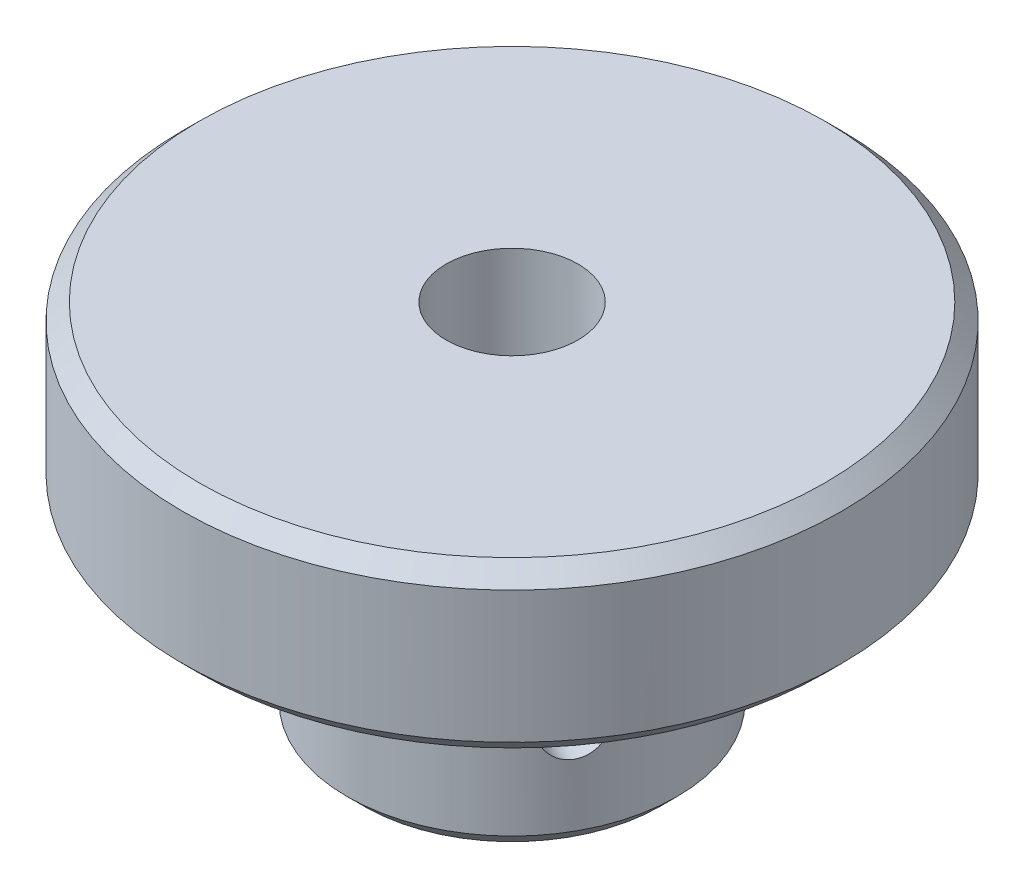
ISO-10303-21;
HEADER;
FILE_DESCRIPTION(('STEP AP214'),'2;1');
FILE_NAME('part.step','',(''),(''),'','','');
FILE_SCHEMA(('AUTOMOTIVE_DESIGN { 1 0 10303 214 1 1 1 1 }'));
ENDSEC;
DATA;
#1=APPLICATION_CONTEXT('core data for automotive mechanical design processes');
#2=APPLICATION_PROTOCOL_DEFINITION('international standard','automotive_design',2000,#1);
#3=PRODUCT_CONTEXT('',#1,'mechanical');
#4=PRODUCT('Part','Part','',(#3));
#5=PRODUCT_RELATED_PRODUCT_CATEGORY('part','',(#4));
#6=PRODUCT_DEFINITION_FORMATION('','',#4);
#7=PRODUCT_DEFINITION_CONTEXT('part definition',#1,'design');
#8=PRODUCT_DEFINITION('design','',#6,#7);
#9=PRODUCT_DEFINITION_SHAPE('','',#8);
#10=(LENGTH_UNIT() NAMED_UNIT(*) SI_UNIT(.MILLI.,.METRE.));
#11=(NAMED_UNIT(*) PLANE_ANGLE_UNIT() SI_UNIT($,.RADIAN.));
#12=(NAMED_UNIT(*) SI_UNIT($,.STERADIAN.) SOLID_ANGLE_UNIT());
#13=UNCERTAINTY_MEASURE_WITH_UNIT(LENGTH_MEASURE(1.E-05),#10,'distance_accuracy_value','');
#14=(GEOMETRIC_REPRESENTATION_CONTEXT(3) GLOBAL_UNCERTAINTY_ASSIGNED_CONTEXT((#13)) GLOBAL_UNIT_ASSIGNED_CONTEXT((#10,
#11,#12)) REPRESENTATION_CONTEXT('',''));
#15=CARTESIAN_POINT('',(0.,0.,0.));
#16=DIRECTION('',(0.,0.,1.));
#17=DIRECTION('',(1.,0.,0.));
#18=AXIS2_PLACEMENT_3D('',#15,#16,#17);
#19=CARTESIAN_POINT('',(0.,10.,0.));
#20=DIRECTION('',(0.,1.,0.));
#21=DIRECTION('',(-1.,0.,0.));
#22=AXIS2_PLACEMENT_3D('',#19,#20,#21);
#23=PLANE('',#22);
#24=CARTESIAN_POINT('',(0.,10.,0.));
#25=DIRECTION('',(0.,1.,0.));
#26=DIRECTION('',(-1.,0.,0.));
#27=AXIS2_PLACEMENT_3D('',#24,#25,#26);
#28=CIRCLE('',#27,19.);
#29=CARTESIAN_POINT('',(-19.,10.,0.));
#30=VERTEX_POINT('',#29);
#31=EDGE_CURVE('E40',#30,#30,#28,.T.);
#32=ORIENTED_EDGE('',*,*,#31,.T.);
#33=EDGE_LOOP('',(#32));
#34=FACE_BOUND('',#33,.T.);
#35=CARTESIAN_POINT('',(0.,10.,0.));
#36=DIRECTION('',(0.,1.,0.));
#37=DIRECTION('',(-1.,0.,0.));
#38=AXIS2_PLACEMENT_3D('',#35,#36,#37);
#39=CIRCLE('',#38,4.);
#40=CARTESIAN_POINT('',(-4.,10.,0.));
#41=VERTEX_POINT('',#40);
#42=EDGE_CURVE('E63',#41,#41,#39,.T.);
#43=ORIENTED_EDGE('',*,*,#42,.F.);
#44=EDGE_LOOP('',(#43));
#45=FACE_BOUND('',#44,.T.);
#46=ADVANCED_FACE('F33',(#34,#45),#23,.T.);
#47=CARTESIAN_POINT('',(0.,-12.,0.));
#48=DIRECTION('',(0.,-1.,0.));
#49=DIRECTION('',(1.,0.,0.));
#50=AXIS2_PLACEMENT_3D('',#47,#48,#49);
#51=CYLINDRICAL_SURFACE('',#50,20.);
#52=CARTESIAN_POINT('',(0.,9.00000000000001,0.));
#53=DIRECTION('',(0.,1.,0.));
#54=DIRECTION('',(-1.,0.,0.));
#55=AXIS2_PLACEMENT_3D('',#52,#53,#54);
#56=CIRCLE('',#55,20.);
#57=CARTESIAN_POINT('',(-20.,9.00000000000001,0.));
#58=VERTEX_POINT('',#57);
#59=EDGE_CURVE('E44',#58,#58,#56,.F.);
#60=ORIENTED_EDGE('',*,*,#59,.T.);
#61=EDGE_LOOP('',(#60));
#62=FACE_BOUND('',#61,.T.);
#63=CARTESIAN_POINT('',(0.,1.00000000000001,0.));
#64=DIRECTION('',(0.,-1.,0.));
#65=DIRECTION('',(1.,0.,0.));
#66=AXIS2_PLACEMENT_3D('',#63,#64,#65);
#67=CIRCLE('',#66,20.);
#68=CARTESIAN_POINT('',(20.,1.00000000000001,0.));
#69=VERTEX_POINT('',#68);
#70=EDGE_CURVE('E48',#69,#69,#67,.F.);
#71=ORIENTED_EDGE('',*,*,#70,.T.);
#72=EDGE_LOOP('',(#71));
#73=FACE_BOUND('',#72,.T.);
#74=ADVANCED_FACE('F109',(#62,#73),#51,.T.);
#75=CARTESIAN_POINT('',(20.,0.,0.));
#76=DIRECTION('',(0.,-1.,0.));
#77=DIRECTION('',(1.,0.,0.));
#78=AXIS2_PLACEMENT_3D('',#75,#76,#77);
#79=PLANE('',#78);
#80=CARTESIAN_POINT('',(0.,0.,0.));
#81=DIRECTION('',(0.,-1.,0.));
#82=DIRECTION('',(1.,0.,0.));
#83=AXIS2_PLACEMENT_3D('',#80,#81,#82);
#84=CIRCLE('',#83,19.);
#85=CARTESIAN_POINT('',(19.,0.,0.));
#86=VERTEX_POINT('',#85);
#87=EDGE_CURVE('E10',#86,#86,#84,.T.);
#88=ORIENTED_EDGE('',*,*,#87,.T.);
#89=EDGE_LOOP('',(#88));
#90=FACE_BOUND('',#89,.T.);
#91=CARTESIAN_POINT('',(0.,0.,0.));
#92=DIRECTION('',(0.,-1.,0.));
#93=DIRECTION('',(1.,0.,0.));
#94=AXIS2_PLACEMENT_3D('',#91,#92,#93);
#95=CIRCLE('',#94,10.);
#96=CARTESIAN_POINT('',(10.,0.,0.));
#97=VERTEX_POINT('',#96);
#98=EDGE_CURVE('E59',#97,#97,#95,.T.);
#99=ORIENTED_EDGE('',*,*,#98,.F.);
#100=EDGE_LOOP('',(#99));
#101=FACE_BOUND('',#100,.T.);
#102=ADVANCED_FACE('F105',(#90,#101),#79,.T.);
#103=CARTESIAN_POINT('',(0.,-12.,0.));
#104=DIRECTION('',(0.,-1.,0.));
#105=DIRECTION('',(1.,0.,0.));
#106=AXIS2_PLACEMENT_3D('',#103,#104,#105);
#107=CYLINDRICAL_SURFACE('',#106,10.);
#108=CARTESIAN_POINT('',(9.39609019943457,-5.5637960661058,3.42249747466519));
#109=CARTESIAN_POINT('',(9.39608980780248,-5.47179422373991,3.42250151496061));
#110=CARTESIAN_POINT('',(9.39341934364294,-5.37974180905924,3.42985765106719));
#111=CARTESIAN_POINT('',(9.38271805600287,-5.19821885276391,3.4590221078147));
#112=CARTESIAN_POINT('',(9.37468225932612,-5.10875078695795,3.48084383666644));
#113=CARTESIAN_POINT('',(9.35322111246821,-4.93504988949026,3.53810446822577));
#114=CARTESIAN_POINT('',(9.33980022765251,-4.85081278692915,3.57353208776078));
#115=CARTESIAN_POINT('',(9.30753943834916,-4.68982584163321,3.6567323184697));
#116=CARTESIAN_POINT('',(9.28870015783612,-4.61307513813756,3.70450350811159));
#117=CARTESIAN_POINT('',(9.24542267422494,-4.46848856365405,3.81123271200631));
#118=CARTESIAN_POINT('',(9.22093745911545,-4.40073553103498,3.87028390011741));
#119=CARTESIAN_POINT('',(9.16656489080921,-4.27678690037909,3.99735598332616));
#120=CARTESIAN_POINT('',(9.13667722011196,-4.22059198202392,4.06537740553786));
#121=CARTESIAN_POINT('',(9.07157999010143,-4.12104438269495,4.20864032857806));
#122=CARTESIAN_POINT('',(9.03634033446551,-4.07776871421619,4.28392172105046));
#123=CARTESIAN_POINT('',(8.96118606823515,-4.00578297732763,4.43898165953918));
#124=CARTESIAN_POINT('',(8.92127175582415,-3.97707198049987,4.51875991854461));
#125=CARTESIAN_POINT('',(8.83795735819996,-3.93528371947005,4.67959765334046));
#126=CARTESIAN_POINT('',(8.79459208958519,-3.92206731691953,4.76063899925598));
#127=CARTESIAN_POINT('',(8.7051590223162,-3.91121081358186,4.92226919105247));
#128=CARTESIAN_POINT('',(8.65909140406356,-3.91356967420226,5.00285806674647));
#129=CARTESIAN_POINT('',(8.56607341433178,-3.93368809380989,5.16049264506234));
#130=CARTESIAN_POINT('',(8.51913595457307,-3.95129791792217,5.23756515001947));
#131=CARTESIAN_POINT('',(8.42547408492829,-4.00118268481555,5.3869438085412));
#132=CARTESIAN_POINT('',(8.37874968147182,-4.03345806725359,5.45924981913724));
#133=CARTESIAN_POINT('',(8.28695292360977,-4.11190704766504,5.59761939801015));
#134=CARTESIAN_POINT('',(8.24188894198544,-4.15814248407168,5.66365343640674));
#135=CARTESIAN_POINT('',(8.15533408432598,-4.26315382904732,5.78759440081469));
#136=CARTESIAN_POINT('',(8.1138434922279,-4.32193073285754,5.84550068123441));
#137=CARTESIAN_POINT('',(8.03563168464842,-4.45118742329912,5.95256917525454));
#138=CARTESIAN_POINT('',(7.99897305218682,-4.52179806483588,6.00161921882916));
#139=CARTESIAN_POINT('',(7.93260542043703,-4.67227656936534,6.08907171993989));
#140=CARTESIAN_POINT('',(7.90289648280762,-4.75214451448089,6.12747408300867));
#141=CARTESIAN_POINT('',(7.85177145278941,-4.91901785988779,6.19285214075249));
#142=CARTESIAN_POINT('',(7.83036436400266,-5.00603088603757,6.21981543237434));
#143=CARTESIAN_POINT('',(7.7969395106955,-5.18464266639263,6.26166579480786));
#144=CARTESIAN_POINT('',(7.78492093690428,-5.27624102462724,6.27655390647962));
#145=CARTESIAN_POINT('',(7.77096607136301,-5.46027476118353,6.29382315078685));
#146=CARTESIAN_POINT('',(7.76891338387365,-5.55268778366602,6.29634867413063));
#147=CARTESIAN_POINT('',(7.77467858665657,-5.7367306527408,6.28922833591185));
#148=CARTESIAN_POINT('',(7.78249610359206,-5.82836052882333,6.27958293470997));
#149=CARTESIAN_POINT('',(7.80752822977126,-6.00765627930492,6.24843132817266));
#150=CARTESIAN_POINT('',(7.8246844193381,-6.09534316570758,6.22699885039333));
#151=CARTESIAN_POINT('',(7.86752757013855,-6.26493027369883,6.17277868338241));
#152=CARTESIAN_POINT('',(7.89321503254636,-6.34683015498383,6.1399903270388));
#153=CARTESIAN_POINT('',(7.95221075753145,-6.50333345528128,6.06338959668827));
#154=CARTESIAN_POINT('',(7.98558586616549,-6.57786415597628,6.01948016746968));
#155=CARTESIAN_POINT('',(8.05835960282304,-6.71676209117471,5.92170125612335));
#156=CARTESIAN_POINT('',(8.09775864573787,-6.78112862501204,5.86783108790799));
#157=CARTESIAN_POINT('',(8.1813753398797,-6.89853816418592,5.75067987542483));
#158=CARTESIAN_POINT('',(8.22563796586839,-6.95145921187159,5.68730860213637));
#159=CARTESIAN_POINT('',(8.31688203109189,-7.04362177176345,5.55302200480818));
#160=CARTESIAN_POINT('',(8.3638633836854,-7.08286371962021,5.48210692111683));
#161=CARTESIAN_POINT('',(8.45857506291787,-7.1463638304509,5.33480414034749));
#162=CARTESIAN_POINT('',(8.50630126770778,-7.17068611140344,5.25844145843101));
#163=CARTESIAN_POINT('',(8.60104024282023,-7.20386303970591,5.10200575410149));
#164=CARTESIAN_POINT('',(8.64805307032513,-7.21271893336137,5.02193303118315));
#165=CARTESIAN_POINT('',(8.73934045624668,-7.21467640543294,4.86131276773048));
#166=CARTESIAN_POINT('',(8.78364088499589,-7.20796365396141,4.78078213216221));
#167=CARTESIAN_POINT('',(8.86891868571736,-7.17937560419376,4.62066140607936));
#168=CARTESIAN_POINT('',(8.90989607539983,-7.15750038671222,4.54107131055407));
#169=CARTESIAN_POINT('',(8.98758847635591,-7.09927905869903,4.38529674782896));
#170=CARTESIAN_POINT('',(9.02430799397675,-7.06294843104704,4.30910873352859));
#171=CARTESIAN_POINT('',(9.09293014210087,-6.97686815397443,4.16235408728425));
#172=CARTESIAN_POINT('',(9.12483255152364,-6.92711788895318,4.09178771341485));
#173=CARTESIAN_POINT('',(9.1837921927189,-6.81495096616707,3.95770052074887));
#174=CARTESIAN_POINT('',(9.21079093445193,-6.75239822395677,3.8942678088189));
#175=CARTESIAN_POINT('',(9.2593278258594,-6.61668769391363,3.77741473058092));
#176=CARTESIAN_POINT('',(9.28086469501704,-6.54352742549073,3.72399671294676));
#177=CARTESIAN_POINT('',(9.31855461077213,-6.38807824033645,3.62866278723007));
#178=CARTESIAN_POINT('',(9.33466938685465,-6.30572968082512,3.58682899541739));
#179=CARTESIAN_POINT('',(9.36131688275133,-6.13467802909182,3.51669811790072));
#180=CARTESIAN_POINT('',(9.37185520270094,-6.04598141392168,3.48838745443675));
#181=CARTESIAN_POINT('',(9.38512254303905,-5.89141076656954,3.45249415035482));
#182=CARTESIAN_POINT('',(9.3892355686163,-5.82647470107992,3.44126716068695));
#183=CARTESIAN_POINT('',(9.39471951306307,-5.69563309173657,3.42626744059655));
#184=CARTESIAN_POINT('',(9.3960904800908,-5.62972756492976,3.42249457925869));
#185=CARTESIAN_POINT('',(9.39609019943457,-5.5637960661058,3.42249747466519));
#186=B_SPLINE_CURVE_WITH_KNOTS('',3,(#108,#109,#110,#111,#112,#113,#114,#115,#116,#117,#118,
#119,#120,#121,#122,#123,#124,#125,#126,#127,#128,#129,#130,#131,#132,#133,#134,#135,#136,#137,
#138,#139,#140,#141,#142,#143,#144,#145,#146,#147,#148,#149,#150,#151,#152,#153,#154,#155,#156,
#157,#158,#159,#160,#161,#162,#163,#164,#165,#166,#167,#168,#169,#170,#171,#172,#173,#174,#175,
#176,#177,#178,#179,#180,#181,#182,#183,#184,#185),.UNSPECIFIED.,.T.,.F.,(4,2,2,2,2,2,2,2,2,2,2,
2,2,2,2,2,2,2,2,2,2,2,2,2,2,2,2,2,2,2,2,2,2,2,2,2,2,2,4),(0.,0.275764439202392,
0.551784843546745,0.827576840629569,1.10333709061228,1.38148219258882,1.65964364637685,
1.93943156735329,2.21920165114179,2.49643973106727,2.77365932434103,3.04818762343249,
3.32272415311683,3.59849508924514,3.8742879176082,4.15336037881897,4.43243531591038,
4.71181207725746,4.99116475423997,5.26724677423092,5.54331835183576,5.81768243813564,
6.09206264495275,6.36892529029639,6.6458070128228,6.92550769092012,7.20519946032491,
7.48368066222355,7.76213942263835,8.03729441534006,8.31244794150175,8.58730754656385,
8.86217976243817,9.14014153059554,9.41816840579299,9.69811840194758,9.97778672322848,
10.175411919191,10.3730336442719),.UNSPECIFIED.);
#187=CARTESIAN_POINT('',(9.39609019943457,-5.5637960661058,3.42249747466519));
#188=VERTEX_POINT('',#187);
#189=EDGE_CURVE('E210',#188,#188,#186,.T.);
#190=ORIENTED_EDGE('',*,*,#189,.F.);
#191=EDGE_LOOP('',(#190));
#192=FACE_BOUND('',#191,.T.);
#193=CARTESIAN_POINT('',(-1.73407534226919,-5.5637960661058,-9.84850154629292));
#194=CARTESIAN_POINT('',(-1.73407164745468,-5.47179422373991,-9.84850322727728));
#195=CARTESIAN_POINT('',(-1.72636581463291,-5.37974180905924,-9.84986860552852));
#196=CARTESIAN_POINT('',(-1.69575801038196,-5.19821885276391,-9.85518324695277));
#197=CARTESIAN_POINT('',(-1.67284194050348,-5.10875078695795,-9.85913490731693));
#198=CARTESIAN_POINT('',(-1.61252220550741,-4.93504988949026,-9.8691793247233));
#199=CARTESIAN_POINT('',(-1.57513054458663,-4.85081278692915,-9.87527030729915));
#200=CARTESIAN_POINT('',(-1.4869466365403,-4.68982584163321,-9.88893175957076));
#201=CARTESIAN_POINT('',(-1.4361559324849,-4.61307513813756,-9.8965020588784));
#202=CARTESIAN_POINT('',(-1.3220869887808,-4.46848856365405,-9.9123872606066));
#203=CARTESIAN_POINT('',(-1.25870455219818,-4.40073553103498,-9.92070803636022));
#204=CARTESIAN_POINT('',(-1.12147061587448,-4.27678690037909,-9.93715605254238));
#205=CARTESIAN_POINT('',(-1.04761850088897,-4.22059198202392,-9.94528328156446));
#206=CARTESIAN_POINT('',(-0.891000555110477,-4.12104438269495,-9.96053888817945));
#207=CARTESIAN_POINT('',(-0.808185128979153,-4.07776871421619,-9.96766114741432));
#208=CARTESIAN_POINT('',(-0.63632215002349,-4.00578297732763,-9.98010561290042));
#209=CARTESIAN_POINT('',(-0.547274994849592,-3.97707198049987,-9.98542793388063));
#210=CARTESIAN_POINT('',(-0.366328231817144,-3.93528371947005,-9.993694416435));
#211=CARTESIAN_POINT('',(-0.274461733190037,-3.92206731691953,-9.99665966513044));
#212=CARTESIAN_POINT('',(-0.0897693474412344,-3.91121081358186,-10.0000234528354));
#213=CARTESIAN_POINT('',(0.00305647529851831,-3.91356967420226,-10.0004221629837));
#214=CARTESIAN_POINT('',(0.186081019500804,-3.93368809380989,-9.998683510025));
#215=CARTESIAN_POINT('',(0.276296496606327,-3.95129791792217,-9.99657072996341));
#216=CARTESIAN_POINT('',(0.452493144491774,-4.00118268481555,-9.99014650074595));
#217=CARTESIAN_POINT('',(0.538474188242488,-4.03345806725359,-9.98583498567399));
#218=CARTESIAN_POINT('',(0.704204137588413,-4.11190704766504,-9.97552145081687));
#219=CARTESIAN_POINT('',(0.783923283166498,-4.15814248407168,-9.96951191713281));
#220=CARTESIAN_POINT('',(0.93453673574306,-4.26315382904732,-9.95652369378275));
#221=CARTESIAN_POINT('',(1.00543034167424,-4.32193073285754,-9.94954492721761));
#222=CARTESIAN_POINT('',(1.13726028123036,-4.45118742329912,-9.93534576198795));
#223=CARTESIAN_POINT('',(1.19806818125351,-4.52179806483588,-9.92812347679552));
#224=CARTESIAN_POINT('',(1.30698808471478,-4.67227656936534,-9.91437367226655));
#225=CARTESIAN_POINT('',(1.3550999755124,-4.75214451448088,-9.90784615909443));
#226=CARTESIAN_POINT('',(1.43728154937774,-4.91901785988779,-9.89625961320133));
#227=CARTESIAN_POINT('',(1.47133598928529,-5.00603088603757,-9.89120217630186));
#228=CARTESIAN_POINT('',(1.52429189296388,-5.18464266639263,-9.88318058543686));
#229=CARTESIAN_POINT('',(1.54319466278162,-5.27624102462724,-9.88021625105228));
#230=CARTESIAN_POINT('',(1.56512769982648,-5.46027476118353,-9.87676560514076));
#231=CARTESIAN_POINT('',(1.56834121094471,-5.55268778366602,-9.87625068730083));
#232=CARTESIAN_POINT('',(1.55929221577226,-5.7367306527408,-9.87768333025942));
#233=CARTESIAN_POINT('',(1.54703029483399,-5.82836052882333,-9.87963079791913));
#234=CARTESIAN_POINT('',(1.50753614911439,-6.00765627930492,-9.8857334518324));
#235=CARTESIAN_POINT('',(1.48039698410802,-6.09534316570758,-9.88987490893976));
#236=CARTESIAN_POINT('',(1.41201936667891,-6.26493027369883,-9.89986808240566));
#237=CARTESIAN_POINT('',(1.37078008593309,-6.34683015498383,-9.90571989923777));
#238=CARTESIAN_POINT('',(1.27494404500854,-6.50333345528128,-9.91851133061427));
#239=CARTESIAN_POINT('',(1.22022980952256,-6.57786415597628,-9.92546030793612));
#240=CARTESIAN_POINT('',(1.09916392001347,-6.71676209117471,-9.93959475693671));
#241=CARTESIAN_POINT('',(1.03281146437541,-6.78112862501204,-9.94678024487807));
#242=CARTESIAN_POINT('',(0.889547191209935,-6.89853816418592,-9.96061881994378));
#243=CARTESIAN_POINT('',(0.812534745677618,-6.95145921187159,-9.96726574184397));
#244=CARTESIAN_POINT('',(0.650617108391875,-7.04362177176345,-9.97914212160799));
#245=CARTESIAN_POINT('',(0.565712168106918,-7.08286371962021,-9.98437162461245));
#246=CARTESIAN_POINT('',(0.390788378296343,-7.1463638304509,-9.99274295447818));
#247=CARTESIAN_POINT('',(0.300793253460604,-7.17068611140344,-9.99589371929422));
#248=CARTESIAN_POINT('',(0.117946471896106,-7.20386303970591,-9.99972222630533));
#249=CARTESIAN_POINT('',(0.0250950459461773,-7.21271893336137,-10.0004001677691));
#250=CARTESIAN_POINT('',(-0.159649875527157,-7.21467640543294,-9.99914723129595));
#251=CARTESIAN_POINT('',(-0.251541666086785,-7.20796365396141,-9.99724721020717));
#252=CARTESIAN_POINT('',(-0.432849182907684,-7.17937560419376,-9.99103958896941));
#253=CARTESIAN_POINT('',(-0.522264922363444,-7.15750038671222,-9.98673200165256));
#254=CARTESIAN_POINT('',(-0.696015851424849,-7.09927905869903,-9.97612831319897));
#255=CARTESIAN_POINT('',(-0.780356366083273,-7.06294843104704,-9.96983434112314));
#256=CARTESIAN_POINT('',(-0.941760691916341,-6.97686815397443,-9.95588554153872));
#257=CARTESIAN_POINT('',(-1.01882416905157,-6.92711788895318,-9.94823065160607));
#258=CARTESIAN_POINT('',(-1.16442690482008,-6.81495096616707,-9.93224760234619));
#259=CARTESIAN_POINT('',(-1.23286061564888,-6.75239822395677,-9.92391284259222));
#260=CARTESIAN_POINT('',(-1.35832679561713,-6.61668769391363,-9.90752048445283));
#261=CARTESIAN_POINT('',(-1.41535659048693,-6.54352742549073,-9.89946295144424));
#262=CARTESIAN_POINT('',(-1.51676314987762,-6.38807824033645,-9.88443641309631));
#263=CARTESIAN_POINT('',(-1.5610496643653,-6.30572968082512,-9.87747532265372));
#264=CARTESIAN_POINT('',(-1.63510853383277,-6.13467802909182,-9.86548729228915));
#265=CARTESIAN_POINT('',(-1.66489544756537,-6.04598141392168,-9.86045841334674));
#266=CARTESIAN_POINT('',(-1.70261363089513,-5.89141076656954,-9.85400161507923));
#267=CARTESIAN_POINT('',(-1.71439300194416,-5.82647470107993,-9.85195010488161));
#268=CARTESIAN_POINT('',(-1.73012511281548,-5.69563309173657,-9.84919948004025));
#269=CARTESIAN_POINT('',(-1.73407799009289,-5.62972756492976,-9.8485003416451));
#270=CARTESIAN_POINT('',(-1.73407534226919,-5.5637960661058,-9.84850154629292));
#271=B_SPLINE_CURVE_WITH_KNOTS('',3,(#193,#194,#195,#196,#197,#198,#199,#200,#201,#202,#203,
#204,#205,#206,#207,#208,#209,#210,#211,#212,#213,#214,#215,#216,#217,#218,#219,#220,#221,#222,
#223,#224,#225,#226,#227,#228,#229,#230,#231,#232,#233,#234,#235,#236,#237,#238,#239,#240,#241,
#242,#243,#244,#245,#246,#247,#248,#249,#250,#251,#252,#253,#254,#255,#256,#257,#258,#259,#260,
#261,#262,#263,#264,#265,#266,#267,#268,#269,#270),.UNSPECIFIED.,.T.,.F.,(4,2,2,2,2,2,2,2,2,2,2,
2,2,2,2,2,2,2,2,2,2,2,2,2,2,2,2,2,2,2,2,2,2,2,2,2,2,2,4),(0.,0.275764439202392,
0.551784843546745,0.827576840629569,1.10333709061228,1.38148219258882,1.65964364637685,
1.9394315673533,2.21920165114179,2.49643973106727,2.77365932434103,3.04818762343249,
3.32272415311683,3.59849508924514,3.87428791760821,4.15336037881897,4.43243531591038,
4.71181207725746,4.99116475423997,5.26724677423092,5.54331835183576,5.81768243813564,
6.09206264495275,6.36892529029639,6.6458070128228,6.92550769092012,7.20519946032491,
7.48368066222355,7.76213942263835,8.03729441534006,8.31244794150175,8.58730754656385,
8.86217976243817,9.14014153059554,9.41816840579299,9.69811840194758,9.97778672322848,
10.175411919191,10.3730336442719),.UNSPECIFIED.);
#272=CARTESIAN_POINT('',(-1.73407534226919,-5.5637960661058,-9.84850154629292));
#273=VERTEX_POINT('',#272);
#274=EDGE_CURVE('E66',#273,#273,#271,.T.);
#275=ORIENTED_EDGE('',*,*,#274,.F.);
#276=EDGE_LOOP('',(#275));
#277=FACE_BOUND('',#276,.T.);
#278=CARTESIAN_POINT('',(0.,-11.,0.));
#279=DIRECTION('',(0.,-1.,0.));
#280=DIRECTION('',(1.,0.,0.));
#281=AXIS2_PLACEMENT_3D('',#278,#279,#280);
#282=CIRCLE('',#281,10.);
#283=CARTESIAN_POINT('',(10.,-11.,0.));
#284=VERTEX_POINT('',#283);
#285=EDGE_CURVE('E53',#284,#284,#282,.F.);
#286=ORIENTED_EDGE('',*,*,#285,.T.);
#287=EDGE_LOOP('',(#286));
#288=FACE_BOUND('',#287,.T.);
#289=ORIENTED_EDGE('',*,*,#98,.T.);
#290=EDGE_LOOP('',(#289));
#291=FACE_BOUND('',#290,.T.);
#292=ADVANCED_FACE('F80',(#192,#277,#288,#291),#107,.T.);
#293=CARTESIAN_POINT('',(10.,-12.,0.));
#294=DIRECTION('',(0.,-1.,0.));
#295=DIRECTION('',(1.,0.,0.));
#296=AXIS2_PLACEMENT_3D('',#293,#294,#295);
#297=PLANE('',#296);
#298=CARTESIAN_POINT('',(0.,-12.,0.));
#299=DIRECTION('',(0.,-1.,0.));
#300=DIRECTION('',(1.,0.,0.));
#301=AXIS2_PLACEMENT_3D('',#298,#299,#300);
#302=CIRCLE('',#301,9.00000000000001);
#303=CARTESIAN_POINT('',(9.00000000000001,-12.,0.));
#304=VERTEX_POINT('',#303);
#305=EDGE_CURVE('E56',#304,#304,#302,.T.);
#306=ORIENTED_EDGE('',*,*,#305,.T.);
#307=EDGE_LOOP('',(#306));
#308=FACE_BOUND('',#307,.T.);
#309=CARTESIAN_POINT('',(0.,-12.,0.));
#310=DIRECTION('',(0.,1.,0.));
#311=DIRECTION('',(-1.,0.,0.));
#312=AXIS2_PLACEMENT_3D('',#309,#310,#311);
#313=CIRCLE('',#312,4.);
#314=CARTESIAN_POINT('',(-4.,-12.,0.));
#315=VERTEX_POINT('',#314);
#316=EDGE_CURVE('E62',#315,#315,#313,.T.);
#317=ORIENTED_EDGE('',*,*,#316,.T.);
#318=EDGE_LOOP('',(#317));
#319=FACE_BOUND('',#318,.T.);
#320=ADVANCED_FACE('F98',(#308,#319),#297,.T.);
#321=CARTESIAN_POINT('',(0.,-12.,0.));
#322=DIRECTION('',(0.,1.,0.));
#323=DIRECTION('',(-1.,0.,0.));
#324=AXIS2_PLACEMENT_3D('',#321,#322,#323);
#325=CYLINDRICAL_SURFACE('',#324,4.);
#326=CARTESIAN_POINT('',(3.98385710217057,-5.5637960661058,0.359002213760742));
#327=CARTESIAN_POINT('',(3.98386033241118,-5.47569958588011,0.359014880179871));
#328=CARTESIAN_POINT('',(3.98318042736838,-5.3874556341322,0.366777808354675));
#329=CARTESIAN_POINT('',(3.98023870469677,-5.21350900502692,0.3973920932626));
#330=CARTESIAN_POINT('',(3.97797255134319,-5.12781396550819,0.420284794917056));
#331=CARTESIAN_POINT('',(3.97124142676262,-4.96179312797516,0.47971365014568));
#332=CARTESIAN_POINT('',(3.9667852767612,-4.8814472458872,0.516194927894825));
#333=CARTESIAN_POINT('',(3.95481809499869,-4.72761429927157,0.601033801282838));
#334=CARTESIAN_POINT('',(3.94730782801639,-4.65412552332176,0.649388422527945));
#335=CARTESIAN_POINT('',(3.92773356248436,-4.5115673782593,0.75906157183803));
#336=CARTESIAN_POINT('',(3.91544080679254,-4.44296681032559,0.820948932433961));
#337=CARTESIAN_POINT('',(3.88524697962236,-4.31644129419704,0.953669352293216));
#338=CARTESIAN_POINT('',(3.8673437777205,-4.25852041463358,1.02450580363616));
#339=CARTESIAN_POINT('',(3.82406991218694,-4.15262469480394,1.17598625022312));
#340=CARTESIAN_POINT('',(3.79841503854798,-4.10517513339964,1.25691859475215));
#341=CARTESIAN_POINT('',(3.73930060813693,-4.0251259207841,1.42316402448174));
#342=CARTESIAN_POINT('',(3.70584446028484,-3.99251980175924,1.5084751836113));
#343=CARTESIAN_POINT('',(3.63305339435657,-3.94477535944957,1.67595588963982));
#344=CARTESIAN_POINT('',(3.5941064760414,-3.92882921818257,1.75806306742625));
#345=CARTESIAN_POINT('',(3.50994707186249,-3.91224941425063,1.92058113912479));
#346=CARTESIAN_POINT('',(3.46473708132109,-3.91160967078379,2.00099269397506));
#347=CARTESIAN_POINT('',(3.37236306270651,-3.9252325622424,2.15281156794265));
#348=CARTESIAN_POINT('',(3.32547660274481,-3.9386082498229,2.22446986373994));
#349=CARTESIAN_POINT('',(3.22910165472262,-3.97836488355356,2.36219601333241));
#350=CARTESIAN_POINT('',(3.17961297529145,-4.00474678739648,2.42826345503385));
#351=CARTESIAN_POINT('',(3.07915379412402,-4.07008372782598,2.55449082390235));
#352=CARTESIAN_POINT('',(3.02817220310961,-4.10922405603067,2.61454550746086));
#353=CARTESIAN_POINT('',(2.92749471529552,-4.1987873452924,2.7268055915911));
#354=CARTESIAN_POINT('',(2.87779927662819,-4.24921426660911,2.77900822624577));
#355=CARTESIAN_POINT('',(2.77842520006189,-4.36398430513444,2.87847770334571));
#356=CARTESIAN_POINT('',(2.7289862259579,-4.42904947700453,2.92515207895442));
#357=CARTESIAN_POINT('',(2.63646543979333,-4.56920573242737,3.00881189393813));
#358=CARTESIAN_POINT('',(2.59338598582366,-4.6443005153691,3.04579374327505));
#359=CARTESIAN_POINT('',(2.51494005215271,-4.80539446965311,3.11091057834761));
#360=CARTESIAN_POINT('',(2.47986100650039,-4.89166363779845,3.13872833874396));
#361=CARTESIAN_POINT('',(2.42195150081638,-5.07084273751169,3.1836315173272));
#362=CARTESIAN_POINT('',(2.39911248704208,-5.16374797997961,3.20072443182441));
#363=CARTESIAN_POINT('',(2.36876734573542,-5.34721896129078,3.22324031242516));
#364=CARTESIAN_POINT('',(2.36037408444916,-5.43755436728866,3.2293396671017));
#365=CARTESIAN_POINT('',(2.3569039225348,-5.61860169580439,3.2318744759268));
#366=CARTESIAN_POINT('',(2.3618225653323,-5.70931348216508,3.2283131642833));
#367=CARTESIAN_POINT('',(2.3837965460427,-5.88259707515527,3.21211396948719));
#368=CARTESIAN_POINT('',(2.40007797901446,-5.9653242457804,3.20005440711299));
#369=CARTESIAN_POINT('',(2.44270851700071,-6.12643313048577,3.16763111901362));
#370=CARTESIAN_POINT('',(2.46905994423972,-6.20481383745745,3.14726547776457));
#371=CARTESIAN_POINT('',(2.53141481836273,-6.35867507180143,3.09735254534978));
#372=CARTESIAN_POINT('',(2.56777659087148,-6.43389626088504,3.06745612763351));
#373=CARTESIAN_POINT('',(2.64746587645599,-6.57625623553553,2.99894692559133));
#374=CARTESIAN_POINT('',(2.69079635928224,-6.64339155384091,2.96033042231004));
#375=CARTESIAN_POINT('',(2.78591925972223,-6.77322569255251,2.87110247766829));
#376=CARTESIAN_POINT('',(2.8381105100377,-6.83514780315451,2.81978162241194));
#377=CARTESIAN_POINT('',(2.94543885220902,-6.94643892176786,2.70747418618682));
#378=CARTESIAN_POINT('',(3.00057613426107,-6.99580711810899,2.64648698065619));
#379=CARTESIAN_POINT('',(3.1112445710036,-7.08050020031258,2.51545525615429));
#380=CARTESIAN_POINT('',(3.16677625748903,-7.11579954110852,2.44539456503056));
#381=CARTESIAN_POINT('',(3.27548399149611,-7.17078772296454,2.29773551017077));
#382=CARTESIAN_POINT('',(3.32866139290632,-7.19048564904473,2.22014156280047));
#383=CARTESIAN_POINT('',(3.4268067525273,-7.21258429502627,2.06514624759203));
#384=CARTESIAN_POINT('',(3.47208775136141,-7.21608089484773,1.98809824928485));
#385=CARTESIAN_POINT('',(3.55708561304329,-7.20861063173551,1.83168208665135));
#386=CARTESIAN_POINT('',(3.59680341611969,-7.19764621611034,1.75231431713384));
#387=CARTESIAN_POINT('',(3.66854131799857,-7.16235142397023,1.59653235247111));
#388=CARTESIAN_POINT('',(3.70077844717894,-7.13849162399124,1.52011008852272));
#389=CARTESIAN_POINT('',(3.75903852071895,-7.0785919512258,1.36972222639627));
#390=CARTESIAN_POINT('',(3.78506027106047,-7.04254974131911,1.29575710259797));
#391=CARTESIAN_POINT('',(3.83218812630829,-6.9574915394194,1.14914343499756));
#392=CARTESIAN_POINT('',(3.85302040519324,-6.90796480933286,1.07670383749951));
#393=CARTESIAN_POINT('',(3.88889167084599,-6.79809321931579,0.938934377497091));
#394=CARTESIAN_POINT('',(3.90392855410958,-6.73774444302498,0.873607102651773));
#395=CARTESIAN_POINT('',(3.92998478108226,-6.60320853875113,0.748064618129387));
#396=CARTESIAN_POINT('',(3.94067074244692,-6.52836830922085,0.688477610185932));
#397=CARTESIAN_POINT('',(3.95778003350778,-6.36953009042473,0.58214246579191));
#398=CARTESIAN_POINT('',(3.96420100957356,-6.2855270743962,0.535401426710401));
#399=CARTESIAN_POINT('',(3.97395023296884,-6.1110676248359,0.457450427170412));
#400=CARTESIAN_POINT('',(3.97729841952554,-6.02065695801469,0.426140955044866));
#401=CARTESIAN_POINT('',(3.98191211888816,-5.83574892202743,0.380684579746799));
#402=CARTESIAN_POINT('',(3.98318462254193,-5.74126637522892,0.366480109852021));
#403=CARTESIAN_POINT('',(3.98378814721134,-5.61893275246315,0.35975364500046));
#404=CARTESIAN_POINT('',(3.98385609105505,-5.59137163382078,0.358998248974663));
#405=CARTESIAN_POINT('',(3.98385710217057,-5.5637960661058,0.359002213760742));
#406=B_SPLINE_CURVE_WITH_KNOTS('',3,(#326,#327,#328,#329,#330,#331,#332,#333,#334,#335,#336,
#337,#338,#339,#340,#341,#342,#343,#344,#345,#346,#347,#348,#349,#350,#351,#352,#353,#354,#355,
#356,#357,#358,#359,#360,#361,#362,#363,#364,#365,#366,#367,#368,#369,#370,#371,#372,#373,#374,
#375,#376,#377,#378,#379,#380,#381,#382,#383,#384,#385,#386,#387,#388,#389,#390,#391,#392,#393,
#394,#395,#396,#397,#398,#399,#400,#401,#402,#403,#404,#405),.UNSPECIFIED.,.T.,.F.,(4,2,2,2,2,2,
2,2,2,2,2,2,2,2,2,2,2,2,2,2,2,2,2,2,2,2,2,2,2,2,2,2,2,2,2,2,2,2,2,4),(0.,0.264211724660744,
0.529148459018596,0.793026677872047,1.05683885985756,1.33523297260791,1.61373292676209,
1.90403076094907,2.19420198072698,2.46953816244269,2.74476495901023,3.00356896819765,
3.2623920368679,3.52515526924738,3.78801084539544,4.06907613148063,4.35024537535723,
4.64031806272421,4.93018777241109,5.20152035698261,5.4727621157604,5.72713321026164,
5.98156300028878,6.24665916965706,6.51186861189121,6.79815687284344,7.0844636389886,
7.37128791456168,7.65794504349148,7.92489841526076,8.19180661499932,8.44957452423756,
8.70739191275385,8.97680852354691,9.24632283025303,9.53374725602171,9.82133016535512,
10.1070334851925,10.3917725616093,10.4744749384331),.UNSPECIFIED.);
#407=CARTESIAN_POINT('',(3.98385710217057,-5.5637960661058,0.359002213760742));
#408=VERTEX_POINT('',#407);
#409=EDGE_CURVE('E207',#408,#408,#406,.T.);
#410=ORIENTED_EDGE('',*,*,#409,.T.);
#411=EDGE_LOOP('',(#410));
#412=FACE_BOUND('',#411,.T.);
#413=CARTESIAN_POINT('',(-1.68102351395365,-5.5637960661058,-3.62962256240713));
#414=CARTESIAN_POINT('',(-1.68101415963321,-5.47569958588011,-3.62963169308713));
#415=CARTESIAN_POINT('',(-1.67395131410468,-5.3874556341322,-3.6329243421353));
#416=CARTESIAN_POINT('',(-1.64596770431992,-5.21350900502692,-3.64568387802476));
#417=CARTESIAN_POINT('',(-1.62500896644911,-5.12781396550819,-3.65516768247892));
#418=CARTESIAN_POINT('',(-1.57017650581301,-4.96179312797516,-3.67905278521042));
#419=CARTESIAN_POINT('',(-1.53635471751902,-4.8814472458872,-3.69343428498069));
#420=CARTESIAN_POINT('',(-1.4568985070553,-4.72761429927157,-3.72548983825665));
#421=CARTESIAN_POINT('',(-1.41126704317551,-4.65412552332176,-3.74316306688334));
#422=CARTESIAN_POINT('',(-1.30650017699392,-4.5115673782593,-3.78104783032722));
#423=CARTESIAN_POINT('',(-1.24675777269876,-4.44296681032559,-3.80134567191355));
#424=CARTESIAN_POINT('',(-1.11672160391463,-4.31644129419704,-3.84155726047633));
#425=CARTESIAN_POINT('',(-1.04642383658676,-4.25852041463358,-3.86147085849171));
#426=CARTESIAN_POINT('',(-0.893600988899064,-4.15262469480394,-3.89973481491318));
#427=CARTESIAN_POINT('',(-0.81068408572961,-4.10517513339964,-3.91798321487546));
#428=CARTESIAN_POINT('',(-0.637154105115197,-4.0251259207841,-3.94991133127405));
#429=CARTESIAN_POINT('',(-0.546544400156661,-3.99251980175924,-3.96359303688615));
#430=CARTESIAN_POINT('',(-0.365106321128069,-3.94477535944957,-3.98429447763798));
#431=CARTESIAN_POINT('',(-0.274525960174399,-3.92882921818257,-3.99161904587114));
#432=CARTESIAN_POINT('',(-0.09170147941994,-3.91224941425063,-3.99999389973412));
#433=CARTESIAN_POINT('',(0.000541965108894231,-3.91160967078379,-4.00104667684554));
#434=CARTESIAN_POINT('',(0.178207976046072,-3.9252325622424,-3.99695786705946));
#435=CARTESIAN_POINT('',(0.263709110579269,-3.9386082498229,-3.99218214953775));
#436=CARTESIAN_POINT('',(0.431170928902863,-3.97836488355356,-3.97758207105836));
#437=CARTESIAN_POINT('',(0.513131351494941,-4.00474678739648,-3.96775733832195));
#438=CARTESIAN_POINT('',(0.672677050171647,-4.07008372782598,-3.94387081982182));
#439=CARTESIAN_POINT('',(0.750176727256758,-4.10922405603067,-3.92974680865725));
#440=CARTESIAN_POINT('',(0.897735555851569,-4.1987873452924,-3.89868758868617));
#441=CARTESIAN_POINT('',(0.967792082940652,-4.24921426660911,-3.88175139367538));
#442=CARTESIAN_POINT('',(1.10362221529351,-4.36398430513444,-3.84542565744132));
#443=CARTESIAN_POINT('',(1.16876289732842,-4.42904947700453,-3.82594743773458));
#444=CARTESIAN_POINT('',(1.28747481546251,-4.56920573242737,-3.78765199402981));
#445=CARTESIAN_POINT('',(1.34104176345204,-4.6443005153691,-3.76883501717937));
#446=CARTESIAN_POINT('',(1.4366575636744,-4.80539446965311,-3.73345726333302));
#447=CARTESIAN_POINT('',(1.47828797368019,-4.89166363779845,-3.71698679885577));
#448=CARTESIAN_POINT('',(1.54613001988594,-5.07084273751169,-3.68928728510444));
#449=CARTESIAN_POINT('',(1.57235242495239,-5.16374797997961,-3.67805457622712));
#450=CARTESIAN_POINT('',(1.60702432019455,-5.34721896129078,-3.6630328532745));
#451=CARTESIAN_POINT('',(1.61650314693425,-5.43755436728866,-3.65881375311827));
#452=CARTESIAN_POINT('',(1.62043343672771,-5.61860169580439,-3.65707590915774));
#453=CARTESIAN_POINT('',(1.6148899289749,-5.70931348216508,-3.65955492295077));
#454=CARTESIAN_POINT('',(1.58987402440541,-5.88259707515527,-3.67048535107019));
#455=CARTESIAN_POINT('',(1.57128942054495,-5.9653242457804,-3.67855570444664));
#456=CARTESIAN_POINT('',(1.52189476038355,-6.12643313048577,-3.69926318927005));
#457=CARTESIAN_POINT('',(1.49108188407801,-6.20481383745745,-3.71190137406048));
#458=CARTESIAN_POINT('',(1.41667857956792,-6.35867507180143,-3.74094581289339));
#459=CARTESIAN_POINT('',(1.3726066360891,-6.43389626088504,-3.75748782275446));
#460=CARTESIAN_POINT('',(1.27343128393532,-6.57625623553553,-3.79224616745899));
#461=CARTESIAN_POINT('',(1.21832316967527,-6.64339155384091,-3.81046321470412));
#462=CARTESIAN_POINT('',(1.09348805266805,-6.77322569255251,-3.84822809064594));
#463=CARTESIAN_POINT('',(1.02294726311437,-6.83514780315451,-3.86776661164623));
#464=CARTESIAN_POINT('',(0.872021999223858,-6.94643892176786,-3.9045619644001));
#465=CARTESIAN_POINT('',(0.791636888902483,-6.99580711810899,-3.92181864858749));
#466=CARTESIAN_POINT('',(0.622825868410888,-7.08050020031258,-3.95214446395268));
#467=CARTESIAN_POINT('',(0.534385686848329,-7.11579954110852,-3.96520596960219));
#468=CARTESIAN_POINT('',(0.352155327237411,-7.17078772296454,-3.98552010141027));
#469=CARTESIAN_POINT('',(0.25836829692971,-7.19048564904473,-3.9927761082536));
#470=CARTESIAN_POINT('',(0.0750657366811389,-7.21258429502627,-4.00027482534471));
#471=CARTESIAN_POINT('',(-0.0143002865806774,-7.21608089484773,-4.0009653214902));
#472=CARTESIAN_POINT('',(-0.192259587824703,-7.20861063173551,-3.99636754765731));
#473=CARTESIAN_POINT('',(-0.280852994006776,-7.19764621611034,-3.99108028934523));
#474=CARTESIAN_POINT('',(-0.451633083795592,-7.16235142397023,-3.97531615245516));
#475=CARTESIAN_POINT('',(-0.533935270379796,-7.13849162399124,-3.96502319329625));
#476=CARTESIAN_POINT('',(-0.693305016172148,-7.0785919512258,-3.94028396594502));
#477=CARTESIAN_POINT('',(-0.770371567546291,-7.04254974131911,-3.92583690089256));
#478=CARTESIAN_POINT('',(-0.920906655854165,-6.9574915394194,-3.89334398696284));
#479=CARTESIAN_POINT('',(-0.994057326969864,-6.90796480933286,-3.87516547094691));
#480=CARTESIAN_POINT('',(-1.131304812024,-6.79809321931579,-3.83734616826688));
#481=CARTESIAN_POINT('',(-1.19539833323185,-6.73774444302498,-3.81770485374423));
#482=CARTESIAN_POINT('',(-1.3171494275688,-6.60320853875113,-3.77749896596815));
#483=CARTESIAN_POINT('',(-1.37409627086566,-6.52836830922086,-3.75695977600207));
#484=CARTESIAN_POINT('',(-1.4747398527564,-6.36953009042473,-3.71860928450451));
#485=CARTESIAN_POINT('',(-1.51842926803316,-6.2855270743962,-3.70079949335382));
#486=CARTESIAN_POINT('',(-1.59081142558282,-6.1110676248359,-3.6702670687113));
#487=CARTESIAN_POINT('',(-1.61960031710097,-6.0206569580147,-3.65751194726324));
#488=CARTESIAN_POINT('',(-1.66127354255436,-5.83574892202743,-3.63877934046765));
#489=CARTESIAN_POINT('',(-1.67421122615742,-5.74126637522892,-3.63277912601084));
#490=CARTESIAN_POINT('',(-1.68033827793124,-5.61893275246315,-3.62993856128058));
#491=CARTESIAN_POINT('',(-1.68102644200135,-5.59137163382078,-3.62961970436237));
#492=CARTESIAN_POINT('',(-1.68102351395365,-5.5637960661058,-3.62962256240713));
#493=B_SPLINE_CURVE_WITH_KNOTS('',3,(#413,#414,#415,#416,#417,#418,#419,#420,#421,#422,#423,
#424,#425,#426,#427,#428,#429,#430,#431,#432,#433,#434,#435,#436,#437,#438,#439,#440,#441,#442,
#443,#444,#445,#446,#447,#448,#449,#450,#451,#452,#453,#454,#455,#456,#457,#458,#459,#460,#461,
#462,#463,#464,#465,#466,#467,#468,#469,#470,#471,#472,#473,#474,#475,#476,#477,#478,#479,#480,
#481,#482,#483,#484,#485,#486,#487,#488,#489,#490,#491,#492),.UNSPECIFIED.,.T.,.F.,(4,2,2,2,2,2,
2,2,2,2,2,2,2,2,2,2,2,2,2,2,2,2,2,2,2,2,2,2,2,2,2,2,2,2,2,2,2,2,2,4),(0.,0.264211724660744,
0.529148459018595,0.793026677872047,1.05683885985756,1.33523297260791,1.61373292676209,
1.90403076094907,2.19420198072698,2.46953816244269,2.74476495901023,3.00356896819765,
3.2623920368679,3.52515526924738,3.78801084539544,4.06907613148063,4.35024537535723,
4.64031806272421,4.93018777241108,5.20152035698261,5.4727621157604,5.72713321026164,
5.98156300028878,6.24665916965706,6.51186861189121,6.79815687284344,7.0844636389886,
7.37128791456167,7.65794504349147,7.92489841526076,8.19180661499932,8.44957452423756,
8.70739191275384,8.97680852354691,9.24632283025303,9.53374725602171,9.82133016535512,
10.1070334851925,10.3917725616093,10.4744749384331),.UNSPECIFIED.);
#494=CARTESIAN_POINT('',(-1.68102351395365,-5.5637960661058,-3.62962256240713));
#495=VERTEX_POINT('',#494);
#496=EDGE_CURVE('E75',#495,#495,#493,.T.);
#497=ORIENTED_EDGE('',*,*,#496,.T.);
#498=EDGE_LOOP('',(#497));
#499=FACE_BOUND('',#498,.T.);
#500=ORIENTED_EDGE('',*,*,#316,.F.);
#501=EDGE_LOOP('',(#500));
#502=FACE_BOUND('',#501,.T.);
#503=ORIENTED_EDGE('',*,*,#42,.T.);
#504=EDGE_LOOP('',(#503));
#505=FACE_BOUND('',#504,.T.);
#506=ADVANCED_FACE('F95',(#412,#499,#502,#505),#325,.F.);
#507=CARTESIAN_POINT('',(0.,-12.,0.));
#508=DIRECTION('',(0.,1.,0.));
#509=DIRECTION('',(-1.,0.,0.));
#510=AXIS2_PLACEMENT_3D('',#507,#508,#509);
#511=CONICAL_SURFACE('',#510,9.00000000000001,0.785398163397448);
#512=ORIENTED_EDGE('',*,*,#285,.F.);
#513=EDGE_LOOP('',(#512));
#514=FACE_BOUND('',#513,.T.);
#515=ORIENTED_EDGE('',*,*,#305,.F.);
#516=EDGE_LOOP('',(#515));
#517=FACE_BOUND('',#516,.T.);
#518=ADVANCED_FACE('F97',(#514,#517),#511,.T.);
#519=CARTESIAN_POINT('',(0.,9.00000000000001,0.));
#520=DIRECTION('',(0.,-1.,0.));
#521=DIRECTION('',(1.,0.,0.));
#522=AXIS2_PLACEMENT_3D('',#519,#520,#521);
#523=CONICAL_SURFACE('',#522,20.,0.785398163397448);
#524=ORIENTED_EDGE('',*,*,#31,.F.);
#525=EDGE_LOOP('',(#524));
#526=FACE_BOUND('',#525,.T.);
#527=ORIENTED_EDGE('',*,*,#59,.F.);
#528=EDGE_LOOP('',(#527));
#529=FACE_BOUND('',#528,.T.);
#530=ADVANCED_FACE('F119',(#526,#529),#523,.T.);
#531=CARTESIAN_POINT('',(0.,0.,0.));
#532=DIRECTION('',(0.,1.,0.));
#533=DIRECTION('',(-1.,0.,0.));
#534=AXIS2_PLACEMENT_3D('',#531,#532,#533);
#535=CONICAL_SURFACE('',#534,19.,0.785398163397441);
#536=ORIENTED_EDGE('',*,*,#70,.F.);
#537=EDGE_LOOP('',(#536));
#538=FACE_BOUND('',#537,.T.);
#539=ORIENTED_EDGE('',*,*,#87,.F.);
#540=EDGE_LOOP('',(#539));
#541=FACE_BOUND('',#540,.T.);
#542=ADVANCED_FACE('F35',(#538,#541),#535,.T.);
#543=CARTESIAN_POINT('',(-0.0853045993664675,-5.5637960661058,-9.99963614964699));
#544=DIRECTION('',(-0.0085304599366473,0.,-0.999963614964699));
#545=DIRECTION('',(-0.999963614964699,0.,0.0085304599366473));
#546=AXIS2_PLACEMENT_3D('',#543,#544,#545);
#547=CYLINDRICAL_SURFACE('',#546,1.64999999999999);
#548=ORIENTED_EDGE('',*,*,#274,.T.);
#549=EDGE_LOOP('',(#548));
#550=FACE_BOUND('',#549,.T.);
#551=ORIENTED_EDGE('',*,*,#496,.F.);
#552=EDGE_LOOP('',(#551));
#553=FACE_BOUND('',#552,.T.);
#554=ADVANCED_FACE('F84',(#550,#553),#547,.F.);
#555=CARTESIAN_POINT('',(8.70259123387871,-5.5637960661058,4.92594212471252));
#556=DIRECTION('',(0.870259123387872,0.,0.492594212471252));
#557=DIRECTION('',(0.492594212471252,0.,-0.870259123387872));
#558=AXIS2_PLACEMENT_3D('',#555,#556,#557);
#559=CYLINDRICAL_SURFACE('',#558,1.64999999999999);
#560=ORIENTED_EDGE('',*,*,#189,.T.);
#561=EDGE_LOOP('',(#560));
#562=FACE_BOUND('',#561,.T.);
#563=ORIENTED_EDGE('',*,*,#409,.F.);
#564=EDGE_LOOP('',(#563));
#565=FACE_BOUND('',#564,.T.);
#566=ADVANCED_FACE('F88',(#562,#565),#559,.F.);
#567=CLOSED_SHELL('',(#46,#74,#102,#292,#320,#506,#518,#530,#542,#554,#566));
#568=MANIFOLD_SOLID_BREP('B2',#567);
#569=ADVANCED_BREP_SHAPE_REPRESENTATION('',(#18,#568),#14);
#570=SHAPE_DEFINITION_REPRESENTATION(#9,#569);
ENDSEC;
END-ISO-10303-21;
